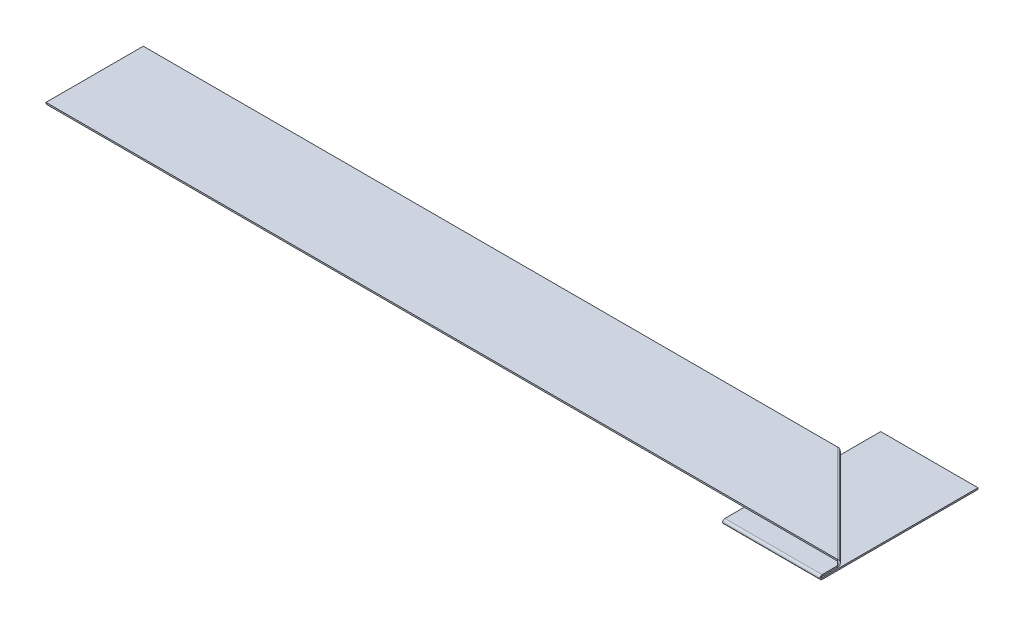
ISO-10303-21;
HEADER;
FILE_DESCRIPTION(('STEP AP214'),'2;1');
FILE_NAME('part.step','',(''),(''),'','','');
FILE_SCHEMA(('AUTOMOTIVE_DESIGN { 1 0 10303 214 1 1 1 1 }'));
ENDSEC;
DATA;
#1=APPLICATION_CONTEXT('core data for automotive mechanical design processes');
#2=APPLICATION_PROTOCOL_DEFINITION('international standard','automotive_design',2000,#1);
#3=PRODUCT_CONTEXT('',#1,'mechanical');
#4=PRODUCT('Part','Part','',(#3));
#5=PRODUCT_RELATED_PRODUCT_CATEGORY('part','',(#4));
#6=PRODUCT_DEFINITION_FORMATION('','',#4);
#7=PRODUCT_DEFINITION_CONTEXT('part definition',#1,'design');
#8=PRODUCT_DEFINITION('design','',#6,#7);
#9=PRODUCT_DEFINITION_SHAPE('','',#8);
#10=(LENGTH_UNIT() NAMED_UNIT(*) SI_UNIT(.MILLI.,.METRE.));
#11=(NAMED_UNIT(*) PLANE_ANGLE_UNIT() SI_UNIT($,.RADIAN.));
#12=(NAMED_UNIT(*) SI_UNIT($,.STERADIAN.) SOLID_ANGLE_UNIT());
#13=UNCERTAINTY_MEASURE_WITH_UNIT(LENGTH_MEASURE(1.E-05),#10,'distance_accuracy_value','');
#14=(GEOMETRIC_REPRESENTATION_CONTEXT(3) GLOBAL_UNCERTAINTY_ASSIGNED_CONTEXT((#13)) GLOBAL_UNIT_ASSIGNED_CONTEXT((#10,
#11,#12)) REPRESENTATION_CONTEXT('',''));
#15=CARTESIAN_POINT('',(0.,0.,0.));
#16=DIRECTION('',(0.,0.,1.));
#17=DIRECTION('',(1.,0.,0.));
#18=AXIS2_PLACEMENT_3D('',#15,#16,#17);
#19=CARTESIAN_POINT('',(0.,0.700000000000184,52.));
#20=DIRECTION('',(0.,-1.,0.));
#21=DIRECTION('',(0.,0.,-1.));
#22=AXIS2_PLACEMENT_3D('',#19,#20,#21);
#23=PLANE('',#22);
#24=DIRECTION('',(0.,0.,-1.));
#25=VECTOR('',#24,1.);
#26=CARTESIAN_POINT('',(16.,0.700000000000184,52.));
#27=LINE('',#26,#25);
#28=CARTESIAN_POINT('',(16.,0.7,25.6465708264711));
#29=VERTEX_POINT('',#28);
#30=CARTESIAN_POINT('',(16.,0.699999999999983,23.1463951570139));
#31=VERTEX_POINT('',#30);
#32=EDGE_CURVE('E79',#29,#31,#27,.T.);
#33=ORIENTED_EDGE('',*,*,#32,.T.);
#34=DIRECTION('',(-0.707106781186553,0.,-0.707106781186542));
#35=VECTOR('',#34,1.);
#36=CARTESIAN_POINT('',(22.4268024214929,0.700000000000027,29.5731975785067));
#37=LINE('',#36,#35);
#38=CARTESIAN_POINT('',(0.,0.699999999999871,7.14639515701417));
#39=VERTEX_POINT('',#38);
#40=EDGE_CURVE('E72',#31,#39,#37,.T.);
#41=ORIENTED_EDGE('',*,*,#40,.T.);
#42=DIRECTION('',(0.,0.,1.));
#43=VECTOR('',#42,1.);
#44=CARTESIAN_POINT('',(0.,0.700000000000184,52.));
#45=LINE('',#44,#43);
#46=CARTESIAN_POINT('',(0.,0.7,25.6465708264711));
#47=VERTEX_POINT('',#46);
#48=EDGE_CURVE('E87',#39,#47,#45,.T.);
#49=ORIENTED_EDGE('',*,*,#48,.T.);
#50=DIRECTION('',(-1.,0.,0.));
#51=VECTOR('',#50,1.);
#52=CARTESIAN_POINT('',(0.,0.7,25.6465708264711));
#53=LINE('',#52,#51);
#54=EDGE_CURVE('E349',#29,#47,#53,.T.);
#55=ORIENTED_EDGE('',*,*,#54,.F.);
#56=EDGE_LOOP('',(#33,#41,#49,#55));
#57=FACE_BOUND('',#56,.T.);
#58=ADVANCED_FACE('F60',(#57),#23,.F.);
#59=CARTESIAN_POINT('',(0.,0.450000000000184,52.));
#60=DIRECTION('',(-1.,0.,0.));
#61=DIRECTION('',(0.,0.,-1.));
#62=AXIS2_PLACEMENT_3D('',#59,#60,#61);
#63=PLANE('',#62);
#64=CARTESIAN_POINT('',(0.,0.449999999999871,7.14639515701417));
#65=CARTESIAN_POINT('',(0.,0.699999999999871,7.14639515701416));
#66=B_SPLINE_CURVE_WITH_KNOTS('',1,(#64,#65),.UNSPECIFIED.,.F.,.F.,(2,2),(0.,1.),.UNSPECIFIED.);
#67=CARTESIAN_POINT('',(0.,0.449999999999871,7.14639515701417));
#68=VERTEX_POINT('',#67);
#69=EDGE_CURVE('E290',#68,#39,#66,.T.);
#70=ORIENTED_EDGE('',*,*,#69,.F.);
#71=DIRECTION('',(0.,0.,1.));
#72=VECTOR('',#71,1.);
#73=CARTESIAN_POINT('',(0.,0.450000000000184,52.));
#74=LINE('',#73,#72);
#75=CARTESIAN_POINT('',(0.,0.45,25.6465708264711));
#76=VERTEX_POINT('',#75);
#77=EDGE_CURVE('E356',#68,#76,#74,.T.);
#78=ORIENTED_EDGE('',*,*,#77,.T.);
#79=DIRECTION('',(0.,1.,0.));
#80=VECTOR('',#79,1.);
#81=CARTESIAN_POINT('',(0.,0.449999999999998,25.6465708264711));
#82=LINE('',#81,#80);
#83=EDGE_CURVE('E352',#76,#47,#82,.T.);
#84=ORIENTED_EDGE('',*,*,#83,.T.);
#85=ORIENTED_EDGE('',*,*,#48,.F.);
#86=EDGE_LOOP('',(#70,#78,#84,#85));
#87=FACE_BOUND('',#86,.T.);
#88=ADVANCED_FACE('F387',(#87),#63,.T.);
#89=CARTESIAN_POINT('',(16.,0.450000000000184,52.));
#90=DIRECTION('',(1.,0.,0.));
#91=DIRECTION('',(0.,0.,1.));
#92=AXIS2_PLACEMENT_3D('',#89,#90,#91);
#93=PLANE('',#92);
#94=CARTESIAN_POINT('',(16.,0.699999999999983,23.1463951570139));
#95=CARTESIAN_POINT('',(16.,0.449999999999982,23.1463951570139));
#96=B_SPLINE_CURVE_WITH_KNOTS('',1,(#94,#95),.UNSPECIFIED.,.F.,.F.,(2,2),(0.,1.),.UNSPECIFIED.);
#97=CARTESIAN_POINT('',(16.,0.449999999999982,23.1463951570139));
#98=VERTEX_POINT('',#97);
#99=EDGE_CURVE('E12',#31,#98,#96,.T.);
#100=ORIENTED_EDGE('',*,*,#99,.F.);
#101=ORIENTED_EDGE('',*,*,#32,.F.);
#102=DIRECTION('',(0.,-1.,0.));
#103=VECTOR('',#102,1.);
#104=CARTESIAN_POINT('',(16.,0.449999999999998,25.6465708264711));
#105=LINE('',#104,#103);
#106=CARTESIAN_POINT('',(16.,0.45,25.6465708264711));
#107=VERTEX_POINT('',#106);
#108=EDGE_CURVE('E345',#29,#107,#105,.T.);
#109=ORIENTED_EDGE('',*,*,#108,.T.);
#110=DIRECTION('',(0.,0.,-1.));
#111=VECTOR('',#110,1.);
#112=CARTESIAN_POINT('',(16.,0.450000000000184,52.));
#113=LINE('',#112,#111);
#114=EDGE_CURVE('E346',#107,#98,#113,.T.);
#115=ORIENTED_EDGE('',*,*,#114,.T.);
#116=EDGE_LOOP('',(#100,#101,#109,#115));
#117=FACE_BOUND('',#116,.T.);
#118=ADVANCED_FACE('F62',(#117),#93,.T.);
#119=CARTESIAN_POINT('',(0.,0.450000000000184,52.));
#120=DIRECTION('',(0.,-1.,0.));
#121=DIRECTION('',(0.,0.,-1.));
#122=AXIS2_PLACEMENT_3D('',#119,#120,#121);
#123=PLANE('',#122);
#124=DIRECTION('',(-0.707106781186553,0.,-0.707106781186542));
#125=VECTOR('',#124,1.);
#126=CARTESIAN_POINT('',(22.4268024214929,0.450000000000027,29.5731975785067));
#127=LINE('',#126,#125);
#128=EDGE_CURVE('E354',#98,#68,#127,.T.);
#129=ORIENTED_EDGE('',*,*,#128,.F.);
#130=ORIENTED_EDGE('',*,*,#114,.F.);
#131=DIRECTION('',(-1.,0.,0.));
#132=VECTOR('',#131,1.);
#133=CARTESIAN_POINT('',(0.,0.45,25.6465708264711));
#134=LINE('',#133,#132);
#135=EDGE_CURVE('E342',#107,#76,#134,.T.);
#136=ORIENTED_EDGE('',*,*,#135,.T.);
#137=ORIENTED_EDGE('',*,*,#77,.F.);
#138=EDGE_LOOP('',(#129,#130,#136,#137));
#139=FACE_BOUND('',#138,.T.);
#140=ADVANCED_FACE('F396',(#139),#123,.T.);
#141=CARTESIAN_POINT('',(0.,0.25,0.));
#142=DIRECTION('',(0.,0.,-1.));
#143=DIRECTION('',(-1.,0.,0.));
#144=AXIS2_PLACEMENT_3D('',#141,#142,#143);
#145=PLANE('',#144);
#146=DIRECTION('',(1.,0.,0.));
#147=VECTOR('',#146,1.);
#148=CARTESIAN_POINT('',(0.,0.,0.));
#149=LINE('',#148,#147);
#150=CARTESIAN_POINT('',(0.,0.,0.));
#151=VERTEX_POINT('',#150);
#152=CARTESIAN_POINT('',(16.,0.,0.));
#153=VERTEX_POINT('',#152);
#154=EDGE_CURVE('E317',#151,#153,#149,.T.);
#155=ORIENTED_EDGE('',*,*,#154,.F.);
#156=DIRECTION('',(0.,-1.,0.));
#157=VECTOR('',#156,1.);
#158=CARTESIAN_POINT('',(0.,0.25,0.));
#159=LINE('',#158,#157);
#160=CARTESIAN_POINT('',(0.,0.25,0.));
#161=VERTEX_POINT('',#160);
#162=EDGE_CURVE('E312',#161,#151,#159,.T.);
#163=ORIENTED_EDGE('',*,*,#162,.F.);
#164=DIRECTION('',(1.,0.,0.));
#165=VECTOR('',#164,1.);
#166=CARTESIAN_POINT('',(0.,0.25,0.));
#167=LINE('',#166,#165);
#168=CARTESIAN_POINT('',(16.,0.25,0.));
#169=VERTEX_POINT('',#168);
#170=EDGE_CURVE('E331',#161,#169,#167,.T.);
#171=ORIENTED_EDGE('',*,*,#170,.T.);
#172=DIRECTION('',(0.,-1.,0.));
#173=VECTOR('',#172,1.);
#174=CARTESIAN_POINT('',(16.,0.25,0.));
#175=LINE('',#174,#173);
#176=EDGE_CURVE('E329',#169,#153,#175,.T.);
#177=ORIENTED_EDGE('',*,*,#176,.T.);
#178=EDGE_LOOP('',(#155,#163,#171,#177));
#179=FACE_BOUND('',#178,.T.);
#180=ADVANCED_FACE('F417',(#179),#145,.T.);
#181=CARTESIAN_POINT('',(0.,0.25,0.));
#182=DIRECTION('',(0.,1.,0.));
#183=DIRECTION('',(0.,0.,1.));
#184=AXIS2_PLACEMENT_3D('',#181,#182,#183);
#185=PLANE('',#184);
#186=DIRECTION('',(-1.,0.,0.));
#187=VECTOR('',#186,1.);
#188=CARTESIAN_POINT('',(0.,0.25,25.6465708264711));
#189=LINE('',#188,#187);
#190=CARTESIAN_POINT('',(16.,0.25,25.6465708264711));
#191=VERTEX_POINT('',#190);
#192=CARTESIAN_POINT('',(0.,0.25,25.6465708264711));
#193=VERTEX_POINT('',#192);
#194=EDGE_CURVE('E306',#191,#193,#189,.T.);
#195=ORIENTED_EDGE('',*,*,#194,.F.);
#196=DIRECTION('',(0.,0.,1.));
#197=VECTOR('',#196,1.);
#198=CARTESIAN_POINT('',(16.,0.25,0.));
#199=LINE('',#198,#197);
#200=EDGE_CURVE('E327',#169,#191,#199,.T.);
#201=ORIENTED_EDGE('',*,*,#200,.F.);
#202=ORIENTED_EDGE('',*,*,#170,.F.);
#203=DIRECTION('',(0.,0.,-1.));
#204=VECTOR('',#203,1.);
#205=CARTESIAN_POINT('',(0.,0.25,0.));
#206=LINE('',#205,#204);
#207=EDGE_CURVE('E315',#193,#161,#206,.T.);
#208=ORIENTED_EDGE('',*,*,#207,.F.);
#209=EDGE_LOOP('',(#195,#201,#202,#208));
#210=FACE_BOUND('',#209,.T.);
#211=ADVANCED_FACE('F425',(#210),#185,.T.);
#212=CARTESIAN_POINT('',(16.,0.25,0.));
#213=DIRECTION('',(1.,0.,0.));
#214=DIRECTION('',(0.,0.,-1.));
#215=AXIS2_PLACEMENT_3D('',#212,#213,#214);
#216=PLANE('',#215);
#217=DIRECTION('',(0.,1.,0.));
#218=VECTOR('',#217,1.);
#219=CARTESIAN_POINT('',(16.,0.250000000000002,25.6465708264711));
#220=LINE('',#219,#218);
#221=CARTESIAN_POINT('',(16.,0.,25.6465708264711));
#222=VERTEX_POINT('',#221);
#223=EDGE_CURVE('E334',#222,#191,#220,.T.);
#224=ORIENTED_EDGE('',*,*,#223,.F.);
#225=DIRECTION('',(0.,0.,1.));
#226=VECTOR('',#225,1.);
#227=CARTESIAN_POINT('',(16.,0.,0.));
#228=LINE('',#227,#226);
#229=EDGE_CURVE('E325',#153,#222,#228,.T.);
#230=ORIENTED_EDGE('',*,*,#229,.F.);
#231=ORIENTED_EDGE('',*,*,#176,.F.);
#232=ORIENTED_EDGE('',*,*,#200,.T.);
#233=EDGE_LOOP('',(#224,#230,#231,#232));
#234=FACE_BOUND('',#233,.T.);
#235=ADVANCED_FACE('F433',(#234),#216,.T.);
#236=CARTESIAN_POINT('',(0.,0.,0.));
#237=DIRECTION('',(0.,1.,0.));
#238=DIRECTION('',(0.,0.,1.));
#239=AXIS2_PLACEMENT_3D('',#236,#237,#238);
#240=PLANE('',#239);
#241=ORIENTED_EDGE('',*,*,#229,.T.);
#242=DIRECTION('',(-1.,0.,0.));
#243=VECTOR('',#242,1.);
#244=CARTESIAN_POINT('',(0.,0.,25.6465708264711));
#245=LINE('',#244,#243);
#246=CARTESIAN_POINT('',(0.,0.,25.6465708264711));
#247=VERTEX_POINT('',#246);
#248=EDGE_CURVE('E322',#222,#247,#245,.T.);
#249=ORIENTED_EDGE('',*,*,#248,.T.);
#250=DIRECTION('',(0.,0.,-1.));
#251=VECTOR('',#250,1.);
#252=CARTESIAN_POINT('',(0.,0.,0.));
#253=LINE('',#252,#251);
#254=EDGE_CURVE('E320',#247,#151,#253,.T.);
#255=ORIENTED_EDGE('',*,*,#254,.T.);
#256=ORIENTED_EDGE('',*,*,#154,.T.);
#257=EDGE_LOOP('',(#241,#249,#255,#256));
#258=FACE_BOUND('',#257,.T.);
#259=ADVANCED_FACE('F441',(#258),#240,.F.);
#260=CARTESIAN_POINT('',(0.,0.25,0.));
#261=DIRECTION('',(-1.,0.,0.));
#262=DIRECTION('',(0.,0.,1.));
#263=AXIS2_PLACEMENT_3D('',#260,#261,#262);
#264=PLANE('',#263);
#265=DIRECTION('',(0.,-1.,0.));
#266=VECTOR('',#265,1.);
#267=CARTESIAN_POINT('',(0.,0.250000000000002,25.6465708264711));
#268=LINE('',#267,#266);
#269=EDGE_CURVE('E337',#193,#247,#268,.T.);
#270=ORIENTED_EDGE('',*,*,#269,.F.);
#271=ORIENTED_EDGE('',*,*,#207,.T.);
#272=ORIENTED_EDGE('',*,*,#162,.T.);
#273=ORIENTED_EDGE('',*,*,#254,.F.);
#274=EDGE_LOOP('',(#270,#271,#272,#273));
#275=FACE_BOUND('',#274,.T.);
#276=ADVANCED_FACE('F450',(#275),#264,.T.);
#277=CARTESIAN_POINT('',(16.,0.35,25.6465708264711));
#278=DIRECTION('',(-1.,0.,0.));
#279=DIRECTION('',(0.,0.,1.));
#280=AXIS2_PLACEMENT_3D('',#277,#278,#279);
#281=PLANE('',#280);
#282=ORIENTED_EDGE('',*,*,#108,.F.);
#283=CARTESIAN_POINT('',(16.,0.35,25.6465708264711));
#284=DIRECTION('',(1.,0.,0.));
#285=DIRECTION('',(0.,0.,-1.));
#286=AXIS2_PLACEMENT_3D('',#283,#284,#285);
#287=CIRCLE('',#286,0.35);
#288=EDGE_CURVE('E307',#29,#222,#287,.T.);
#289=ORIENTED_EDGE('',*,*,#288,.T.);
#290=ORIENTED_EDGE('',*,*,#223,.T.);
#291=CARTESIAN_POINT('',(16.,0.35,25.6465708264711));
#292=DIRECTION('',(1.,0.,0.));
#293=DIRECTION('',(0.,0.,1.));
#294=AXIS2_PLACEMENT_3D('',#291,#292,#293);
#295=CIRCLE('',#294,0.1);
#296=EDGE_CURVE('E294',#107,#191,#295,.T.);
#297=ORIENTED_EDGE('',*,*,#296,.F.);
#298=EDGE_LOOP('',(#282,#289,#290,#297));
#299=FACE_BOUND('',#298,.T.);
#300=ADVANCED_FACE('F458',(#299),#281,.F.);
#301=CARTESIAN_POINT('',(0.,0.35,25.6465708264711));
#302=DIRECTION('',(1.,0.,0.));
#303=DIRECTION('',(0.,0.,-1.));
#304=AXIS2_PLACEMENT_3D('',#301,#302,#303);
#305=PLANE('',#304);
#306=CARTESIAN_POINT('',(0.,0.35,25.6465708264711));
#307=DIRECTION('',(1.,0.,0.));
#308=DIRECTION('',(0.,0.,-1.));
#309=AXIS2_PLACEMENT_3D('',#306,#307,#308);
#310=CIRCLE('',#309,0.35);
#311=EDGE_CURVE('E303',#247,#47,#310,.F.);
#312=ORIENTED_EDGE('',*,*,#311,.T.);
#313=ORIENTED_EDGE('',*,*,#83,.F.);
#314=CARTESIAN_POINT('',(0.,0.35,25.6465708264711));
#315=DIRECTION('',(-1.,0.,0.));
#316=DIRECTION('',(0.,0.,-1.));
#317=AXIS2_PLACEMENT_3D('',#314,#315,#316);
#318=CIRCLE('',#317,0.1);
#319=EDGE_CURVE('E302',#193,#76,#318,.T.);
#320=ORIENTED_EDGE('',*,*,#319,.F.);
#321=ORIENTED_EDGE('',*,*,#269,.T.);
#322=EDGE_LOOP('',(#312,#313,#320,#321));
#323=FACE_BOUND('',#322,.T.);
#324=ADVANCED_FACE('F465',(#323),#305,.F.);
#325=CARTESIAN_POINT('',(-8.01755751426557,0.35,25.6465708264711));
#326=DIRECTION('',(1.,0.,0.));
#327=DIRECTION('',(0.,0.,-1.));
#328=AXIS2_PLACEMENT_3D('',#325,#326,#327);
#329=CYLINDRICAL_SURFACE('',#328,0.1);
#330=ORIENTED_EDGE('',*,*,#194,.T.);
#331=ORIENTED_EDGE('',*,*,#319,.T.);
#332=ORIENTED_EDGE('',*,*,#135,.F.);
#333=ORIENTED_EDGE('',*,*,#296,.T.);
#334=EDGE_LOOP('',(#330,#331,#332,#333));
#335=FACE_BOUND('',#334,.T.);
#336=ADVANCED_FACE('F265',(#335),#329,.F.);
#337=CARTESIAN_POINT('',(-8.01755751426557,0.35,25.6465708264711));
#338=DIRECTION('',(1.,0.,0.));
#339=DIRECTION('',(0.,0.,-1.));
#340=AXIS2_PLACEMENT_3D('',#337,#338,#339);
#341=CYLINDRICAL_SURFACE('',#340,0.35);
#342=ORIENTED_EDGE('',*,*,#248,.F.);
#343=ORIENTED_EDGE('',*,*,#288,.F.);
#344=ORIENTED_EDGE('',*,*,#54,.T.);
#345=ORIENTED_EDGE('',*,*,#311,.F.);
#346=EDGE_LOOP('',(#342,#343,#344,#345));
#347=FACE_BOUND('',#346,.T.);
#348=ADVANCED_FACE('F482',(#347),#341,.T.);
#349=CARTESIAN_POINT('',(15.5001756694572,1.14999999999998,22.6465708264711));
#350=CARTESIAN_POINT('',(15.5537921167749,1.14999999999998,22.6188467692373));
#351=CARTESIAN_POINT('',(15.610145320859,1.13555392953664,22.5940041537666));
#352=CARTESIAN_POINT('',(15.718938512228,1.08115460482738,22.5595312619955));
#353=CARTESIAN_POINT('',(15.7712872506231,1.04125420669122,22.5499817803662));
#354=CARTESIAN_POINT('',(15.8646371181336,0.945401271251354,22.5535086403211));
#355=CARTESIAN_POINT('',(15.9055946098356,0.889541867676836,22.5666286193186));
#356=CARTESIAN_POINT('',(15.9434051297194,0.825137932580997,22.5959992493095));
#357=CARTESIAN_POINT('',(15.9474944555379,0.817961511614417,22.5994626067456));
#358=CARTESIAN_POINT('',(15.9524655671424,0.808982460021814,22.6040424880173));
#359=CARTESIAN_POINT('',(15.9534527650749,0.807186223669721,22.6049709956005));
#360=CARTESIAN_POINT('',(15.9554131052039,0.803593324876642,22.6068530803836));
#361=CARTESIAN_POINT('',(15.9567983305608,0.80103031915711,22.6082187407441));
#362=CARTESIAN_POINT('',(15.9584604205846,0.797939361685722,22.609880830768));
#363=CARTESIAN_POINT('',(15.9595718933155,0.795873565118556,22.611018040062));
#364=CARTESIAN_POINT('',(15.9651453621157,0.785520422299517,22.6168507913512));
#365=CARTESIAN_POINT('',(15.9696556014448,0.777160402464013,22.6219865199826));
#366=CARTESIAN_POINT('',(15.9787555724744,0.760330208940822,22.6332204686517));
#367=CARTESIAN_POINT('',(15.983345289421,0.751860036426322,22.6393187034434));
#368=CARTESIAN_POINT('',(15.9902734569191,0.739109515053051,22.6492039513861));
#369=CARTESIAN_POINT('',(15.9925901291847,0.734851836035317,22.6526219989062));
#370=CARTESIAN_POINT('',(15.9960742359479,0.728459072468827,22.6579353437801));
#371=CARTESIAN_POINT('',(15.9972371225527,0.726327112811992,22.6597375030474));
#372=CARTESIAN_POINT('',(15.9995656428455,0.722061980312805,22.6634041984848));
#373=CARTESIAN_POINT('',(16.0010711164162,0.71930749213181,22.665820887556));
#374=CARTESIAN_POINT('',(16.0283630676331,0.66941073736815,22.7101633255669));
#375=CARTESIAN_POINT('',(16.0474316350071,0.607995948186441,22.7656042844376));
#376=CARTESIAN_POINT('',(16.0493082551733,0.497799445262164,22.9228384689295));
#377=CARTESIAN_POINT('',(16.0303469008345,0.449999999999981,23.0253772745847));
#378=CARTESIAN_POINT('',(16.,0.449999999999982,23.1463951570139));
#379=CARTESIAN_POINT('',(15.5001756694572,0.899999999999979,22.6465708264711));
#380=CARTESIAN_POINT('',(15.5247368917391,0.899999999999979,22.6478966771065));
#381=CARTESIAN_POINT('',(15.5520966336782,0.895872551296167,22.6520528409475));
#382=CARTESIAN_POINT('',(15.6097233667829,0.880329887093522,22.6687464074407));
#383=CARTESIAN_POINT('',(15.6399655980264,0.868929773340333,22.6813034329629));
#384=CARTESIAN_POINT('',(15.7012358199813,0.841543220357516,22.7169099384734));
#385=CARTESIAN_POINT('',(15.7322513428603,0.825583390764796,22.7399718862939));
#386=CARTESIAN_POINT('',(15.7670476163537,0.807182266451699,22.7723567626751));
#387=CARTESIAN_POINT('',(15.7709133820357,0.805131860461248,22.7760436802478));
#388=CARTESIAN_POINT('',(15.7757447685214,0.802566417149076,22.7807632866384));
#389=CARTESIAN_POINT('',(15.7767110056148,0.802053206762763,22.7817127550606));
#390=CARTESIAN_POINT('',(15.778643397406,0.801026664250455,22.7836227881816));
#391=CARTESIAN_POINT('',(15.7800216352641,0.800294376902017,22.7849954360408));
#392=CARTESIAN_POINT('',(15.781683725288,0.799411246195907,22.7866575260646));
#393=CARTESIAN_POINT('',(15.7828043896485,0.798821018605288,22.7877855437289));
#394=CARTESIAN_POINT('',(15.7884704593377,0.795862977799848,22.7935256941292));
#395=CARTESIAN_POINT('',(15.7932040877033,0.79347440070399,22.7984380337241));
#396=CARTESIAN_POINT('',(15.8030661936042,0.788665773983078,22.8089098475219));
#397=CARTESIAN_POINT('',(15.808194666924,0.786245724693221,22.8144693259404));
#398=CARTESIAN_POINT('',(15.8161789345809,0.782602718586572,22.8232984737242));
#399=CARTESIAN_POINT('',(15.8188889551517,0.78138623886722,22.8263231729392));
#400=CARTESIAN_POINT('',(15.8230263612401,0.77955973499108,22.8309832184878));
#401=CARTESIAN_POINT('',(15.8244175595101,0.778950603660555,22.83255706609));
#402=CARTESIAN_POINT('',(15.8272239994974,0.777731994375073,22.8357458418329));
#403=CARTESIAN_POINT('',(15.8290549071755,0.776944997751932,22.8378370967968));
#404=CARTESIAN_POINT('',(15.8624363179617,0.762688782105172,22.8760900752384));
#405=CARTESIAN_POINT('',(15.8944950251559,0.745141699481827,22.9185408942888));
#406=CARTESIAN_POINT('',(15.9518564897241,0.713656984360605,23.0202902343787));
#407=CARTESIAN_POINT('',(15.9764883682956,0.699999999999982,23.080001795845));
#408=CARTESIAN_POINT('',(16.,0.699999999999983,23.1463951570139));
#409=B_SPLINE_SURFACE_WITH_KNOTS('',1,3,((#349,#350,#351,#352,#353,#354,#355,#356,#357,#358,
#359,#360,#361,#362,#363,#364,#365,#366,#367,#368,#369,#370,#371,#372,#373,#374,#375,#376,#377,
#378),(#379,#380,#381,#382,#383,#384,#385,#386,#387,#388,#389,#390,#391,#392,#393,#394,#395,
#396,#397,#398,#399,#400,#401,#402,#403,#404,#405,#406,#407,#408)),.UNSPECIFIED.,.F.,.F.,.F.,(2,
2),(4,2,2,2,2,2,2,2,2,2,2,2,2,2,4),(0.,1.),(0.,0.125,0.25,0.375,0.390625,0.39453125,0.3984375,
0.40625,0.4375,0.46875,0.484375,0.4921875,0.5,0.75,1.),.UNSPECIFIED.);
#410=CARTESIAN_POINT('',(15.5001756694572,1.14999999999998,22.6465708264711));
#411=CARTESIAN_POINT('',(15.5001756694572,0.899999999999979,22.6465708264711));
#412=B_SPLINE_CURVE_WITH_KNOTS('',1,(#410,#411),.UNSPECIFIED.,.F.,.F.,(2,2),(0.,1.),.UNSPECIFIED.);
#413=CARTESIAN_POINT('',(15.5001756694572,0.899999999999979,22.6465708264711));
#414=VERTEX_POINT('',#413);
#415=CARTESIAN_POINT('',(15.5001756694572,1.14999999999998,22.6465708264711));
#416=VERTEX_POINT('',#415);
#417=EDGE_CURVE('E161',#414,#416,#412,.F.);
#418=CARTESIAN_POINT('',(15.5001756694572,0.899999999999979,22.6465708264711));
#419=CARTESIAN_POINT('',(15.5247368917391,0.899999999999979,22.6478966771065));
#420=CARTESIAN_POINT('',(15.5520966336782,0.895872551296167,22.6520528409475));
#421=CARTESIAN_POINT('',(15.6097233667829,0.880329887093522,22.6687464074407));
#422=CARTESIAN_POINT('',(15.6399655980264,0.868929773340333,22.6813034329629));
#423=CARTESIAN_POINT('',(15.7012358199813,0.841543220357516,22.7169099384734));
#424=CARTESIAN_POINT('',(15.7322513428603,0.825583390764796,22.7399718862939));
#425=CARTESIAN_POINT('',(15.7670476163537,0.807182266451699,22.7723567626751));
#426=CARTESIAN_POINT('',(15.7709133820357,0.805131860461248,22.7760436802478));
#427=CARTESIAN_POINT('',(15.7757447685214,0.802566417149076,22.7807632866384));
#428=CARTESIAN_POINT('',(15.7767110056148,0.802053206762763,22.7817127550606));
#429=CARTESIAN_POINT('',(15.778643397406,0.801026664250455,22.7836227881816));
#430=CARTESIAN_POINT('',(15.7800216352641,0.800294376902017,22.7849954360408));
#431=CARTESIAN_POINT('',(15.781683725288,0.799411246195907,22.7866575260646));
#432=CARTESIAN_POINT('',(15.7828043896485,0.798821018605288,22.7877855437289));
#433=CARTESIAN_POINT('',(15.7884704593377,0.795862977799848,22.7935256941292));
#434=CARTESIAN_POINT('',(15.7932040877033,0.79347440070399,22.7984380337241));
#435=CARTESIAN_POINT('',(15.8030661936042,0.788665773983078,22.8089098475219));
#436=CARTESIAN_POINT('',(15.808194666924,0.786245724693221,22.8144693259404));
#437=CARTESIAN_POINT('',(15.8161789345809,0.782602718586572,22.8232984737242));
#438=CARTESIAN_POINT('',(15.8188889551517,0.78138623886722,22.8263231729392));
#439=CARTESIAN_POINT('',(15.8230263612401,0.77955973499108,22.8309832184878));
#440=CARTESIAN_POINT('',(15.8244175595101,0.778950603660555,22.83255706609));
#441=CARTESIAN_POINT('',(15.8272239994974,0.777731994375073,22.8357458418329));
#442=CARTESIAN_POINT('',(15.8290549071755,0.776944997751932,22.8378370967968));
#443=CARTESIAN_POINT('',(15.8624363179617,0.762688782105172,22.8760900752384));
#444=CARTESIAN_POINT('',(15.8944950251559,0.745141699481827,22.9185408942888));
#445=CARTESIAN_POINT('',(15.9518564897241,0.713656984360605,23.0202902343787));
#446=CARTESIAN_POINT('',(15.9764883682956,0.699999999999982,23.080001795845));
#447=CARTESIAN_POINT('',(16.,0.699999999999983,23.1463951570139));
#448=B_SPLINE_CURVE_WITH_KNOTS('',3,(#418,#419,#420,#421,#422,#423,#424,#425,#426,#427,#428,
#429,#430,#431,#432,#433,#434,#435,#436,#437,#438,#439,#440,#441,#442,#443,#444,#445,#446,#447),
.UNSPECIFIED.,.F.,.F.,(4,2,2,2,2,2,2,2,2,2,2,2,2,2,4),(0.,0.125,0.25,0.375,0.390625,0.39453125,
0.3984375,0.40625,0.4375,0.46875,0.484375,0.4921875,0.5,0.75,1.),.UNSPECIFIED.);
#449=EDGE_CURVE('E172',#414,#31,#448,.T.);
#450=CARTESIAN_POINT('',(16.,0.449999999999982,23.1463951570139));
#451=CARTESIAN_POINT('',(16.0303469008345,0.449999999999981,23.0253772745847));
#452=CARTESIAN_POINT('',(16.0493082551733,0.497799445262164,22.9228384689295));
#453=CARTESIAN_POINT('',(16.0474316350071,0.607995948186441,22.7656042844376));
#454=CARTESIAN_POINT('',(16.0283630676331,0.66941073736815,22.7101633255669));
#455=CARTESIAN_POINT('',(16.0010711164162,0.71930749213181,22.665820887556));
#456=CARTESIAN_POINT('',(15.9995656428455,0.722061980312805,22.6634041984848));
#457=CARTESIAN_POINT('',(15.9972371225527,0.726327112811992,22.6597375030474));
#458=CARTESIAN_POINT('',(15.9960742359479,0.728459072468827,22.6579353437801));
#459=CARTESIAN_POINT('',(15.9925901291847,0.734851836035317,22.6526219989062));
#460=CARTESIAN_POINT('',(15.9902734569191,0.739109515053051,22.6492039513861));
#461=CARTESIAN_POINT('',(15.983345289421,0.751860036426322,22.6393187034434));
#462=CARTESIAN_POINT('',(15.9787555724744,0.760330208940822,22.6332204686517));
#463=CARTESIAN_POINT('',(15.9696556014448,0.777160402464013,22.6219865199826));
#464=CARTESIAN_POINT('',(15.9651453621157,0.785520422299517,22.6168507913512));
#465=CARTESIAN_POINT('',(15.9595718933155,0.795873565118556,22.611018040062));
#466=CARTESIAN_POINT('',(15.9584604205846,0.797939361685722,22.609880830768));
#467=CARTESIAN_POINT('',(15.9567983305608,0.80103031915711,22.6082187407441));
#468=CARTESIAN_POINT('',(15.9554131052039,0.803593324876642,22.6068530803836));
#469=CARTESIAN_POINT('',(15.9534527650749,0.807186223669721,22.6049709956005));
#470=CARTESIAN_POINT('',(15.9524655671424,0.808982460021814,22.6040424880173));
#471=CARTESIAN_POINT('',(15.9474944555379,0.817961511614417,22.5994626067456));
#472=CARTESIAN_POINT('',(15.9434051297194,0.825137932580997,22.5959992493095));
#473=CARTESIAN_POINT('',(15.9055946098356,0.889541867676836,22.5666286193186));
#474=CARTESIAN_POINT('',(15.8646371181336,0.945401271251354,22.5535086403211));
#475=CARTESIAN_POINT('',(15.7712872506231,1.04125420669122,22.5499817803662));
#476=CARTESIAN_POINT('',(15.718938512228,1.08115460482738,22.5595312619955));
#477=CARTESIAN_POINT('',(15.610145320859,1.13555392953664,22.5940041537666));
#478=CARTESIAN_POINT('',(15.5537921167749,1.14999999999998,22.6188467692373));
#479=CARTESIAN_POINT('',(15.5001756694572,1.14999999999998,22.6465708264711));
#480=B_SPLINE_CURVE_WITH_KNOTS('',3,(#450,#451,#452,#453,#454,#455,#456,#457,#458,#459,#460,
#461,#462,#463,#464,#465,#466,#467,#468,#469,#470,#471,#472,#473,#474,#475,#476,#477,#478,#479),
.UNSPECIFIED.,.F.,.F.,(4,2,2,2,2,2,2,2,2,2,2,2,2,2,4),(0.,0.25,0.5,0.5078125,0.515625,0.53125,
0.5625,0.59375,0.6015625,0.60546875,0.609375,0.625,0.75,0.875,1.),.UNSPECIFIED.);
#481=EDGE_CURVE('E688',#416,#98,#480,.F.);
#482=ORIENTED_EDGE('',*,*,#417,.F.);
#483=ORIENTED_EDGE('',*,*,#449,.T.);
#484=ORIENTED_EDGE('',*,*,#99,.T.);
#485=ORIENTED_EDGE('',*,*,#481,.F.);
#486=EDGE_LOOP('',(#482,#483,#484,#485));
#487=FACE_BOUND('',#486,.T.);
#488=ADVANCED_FACE('F261',(#487),#409,.T.);
#489=CARTESIAN_POINT('',(0.,0.449999999999871,7.14639515701417));
#490=CARTESIAN_POINT('',(0.0277240572280018,0.44999999999987,7.09277870969062));
#491=CARTESIAN_POINT('',(0.0525666726946304,0.464446070463212,7.03642550560246));
#492=CARTESIAN_POINT('',(0.0870395644613408,0.518845395172469,6.92763231422912));
#493=CARTESIAN_POINT('',(0.0965890460903188,0.558745793308632,6.87528357583365));
#494=CARTESIAN_POINT('',(0.0930621861384264,0.654598728748494,6.78193370832618));
#495=CARTESIAN_POINT('',(0.0799422071442353,0.710458132323013,6.74097621662751));
#496=CARTESIAN_POINT('',(0.0505715771592036,0.774862067418853,6.70316569674949));
#497=CARTESIAN_POINT('',(0.0471082197237716,0.782038488385433,6.69907637093162));
#498=CARTESIAN_POINT('',(0.0425283384528825,0.791017539978035,6.694105259328));
#499=CARTESIAN_POINT('',(0.0415998308698983,0.792813776330129,6.69311806139569));
#500=CARTESIAN_POINT('',(0.0397177460871115,0.796406675123208,6.6911577212671));
#501=CARTESIAN_POINT('',(0.0383520857264845,0.798969680843466,6.68977249591007));
#502=CARTESIAN_POINT('',(0.0366899957041341,0.802060638312675,6.68811040588772));
#503=CARTESIAN_POINT('',(0.0355527864110862,0.8041264348785,6.68699893315776));
#504=CARTESIAN_POINT('',(0.0297200351262177,0.814479577691397,6.68142546436154));
#505=CARTESIAN_POINT('',(0.0245843064972658,0.822839597523787,6.67691522503429));
#506=CARTESIAN_POINT('',(0.0133503578306321,0.839669791044363,6.66781525400584));
#507=CARTESIAN_POINT('',(0.00725212303891071,0.848139963559361,6.66322553705869));
#508=CARTESIAN_POINT('',(-0.00263312490611063,0.860890484936009,6.6562973695584));
#509=CARTESIAN_POINT('',(-0.00605117242744464,0.865148163955307,6.65398069729179));
#510=CARTESIAN_POINT('',(-0.0113645173037075,0.87154092752478,6.6504965905269));
#511=CARTESIAN_POINT('',(-0.0131666765718935,0.873672887182715,6.64933370392149));
#512=CARTESIAN_POINT('',(-0.0168333720112998,0.877938019684312,6.64700518362729));
#513=CARTESIAN_POINT('',(-0.0192500610847591,0.880692507867913,6.64549971005516));
#514=CARTESIAN_POINT('',(-0.0635924990985225,0.930589262635331,6.61820775883674));
#515=CARTESIAN_POINT('',(-0.119033457971828,0.992004051818261,6.59913919146325));
#516=CARTESIAN_POINT('',(-0.276267642465013,1.10220055474078,6.59726257129837));
#517=CARTESIAN_POINT('',(-0.378806448118535,1.14999999999986,6.61622392563739));
#518=CARTESIAN_POINT('',(-0.499824330542794,1.14999999999987,6.64657082647135));
#519=CARTESIAN_POINT('',(0.,0.699999999999871,7.14639515701416));
#520=CARTESIAN_POINT('',(-0.00132585064121473,0.69999999999987,7.1218339347264));
#521=CARTESIAN_POINT('',(-0.00548201448620411,0.704127448703682,7.09447419278329));
#522=CARTESIAN_POINT('',(-0.0221755809837956,0.719670112906326,7.03684745967426));
#523=CARTESIAN_POINT('',(-0.0347326065064068,0.731070226659516,7.00660522843038));
#524=CARTESIAN_POINT('',(-0.0703391120138617,0.758456779642334,6.94533500647847));
#525=CARTESIAN_POINT('',(-0.0934010598310798,0.774416609235053,6.91431948360283));
#526=CARTESIAN_POINT('',(-0.125785936206464,0.79281773354815,6.87952321011517));
#527=CARTESIAN_POINT('',(-0.129472853778484,0.794868139538602,6.87565744443388));
#528=CARTESIAN_POINT('',(-0.134192460168205,0.797433582850774,6.87082605794909));
#529=CARTESIAN_POINT('',(-0.135141928590234,0.797946793237087,6.86985982085583));
#530=CARTESIAN_POINT('',(-0.137051961710808,0.798973335749395,6.86792742906502));
#531=CARTESIAN_POINT('',(-0.138424609570151,0.79970562309804,6.86654919120671));
#532=CARTESIAN_POINT('',(-0.140086699592502,0.800588753803528,6.86488710118436));
#533=CARTESIAN_POINT('',(-0.141214717255874,0.801178981393764,6.86376643682472));
#534=CARTESIAN_POINT('',(-0.146954867651939,0.804137022197449,6.8581003671397));
#535=CARTESIAN_POINT('',(-0.15186720724457,0.806525599292417,6.85336673877613));
#536=CARTESIAN_POINT('',(-0.162339021040422,0.811334226012582,6.8435046328769));
#537=CARTESIAN_POINT('',(-0.167898499459083,0.813754275302581,6.83837615955669));
#538=CARTESIAN_POINT('',(-0.176727647245273,0.817397281410195,6.83039189189756));
#539=CARTESIAN_POINT('',(-0.179752346461346,0.818613761129994,6.8276818713257));
#540=CARTESIAN_POINT('',(-0.18441239201212,0.820440265006986,6.82354446523532));
#541=CARTESIAN_POINT('',(-0.185986239615028,0.821049396337825,6.82215326696463));
#542=CARTESIAN_POINT('',(-0.189175015359717,0.822268005623995,6.81934682697571));
#543=CARTESIAN_POINT('',(-0.191266270325559,0.823055002247882,6.81751591929597));
#544=CARTESIAN_POINT('',(-0.229519248769559,0.837311217895715,6.78413450850778));
#545=CARTESIAN_POINT('',(-0.271970067821501,0.854858300519409,6.75207580131293));
#546=CARTESIAN_POINT('',(-0.373719407911722,0.886343015640128,6.69471433674508));
#547=CARTESIAN_POINT('',(-0.433430969376704,0.899999999999866,6.6700824581744));
#548=CARTESIAN_POINT('',(-0.499824330542801,0.899999999999867,6.64657082647136));
#549=B_SPLINE_SURFACE_WITH_KNOTS('',1,3,((#489,#490,#491,#492,#493,#494,#495,#496,#497,#498,
#499,#500,#501,#502,#503,#504,#505,#506,#507,#508,#509,#510,#511,#512,#513,#514,#515,#516,#517,
#518),(#519,#520,#521,#522,#523,#524,#525,#526,#527,#528,#529,#530,#531,#532,#533,#534,#535,
#536,#537,#538,#539,#540,#541,#542,#543,#544,#545,#546,#547,#548)),.UNSPECIFIED.,.F.,.F.,.F.,(2,
2),(4,2,2,2,2,2,2,2,2,2,2,2,2,2,4),(0.,1.),(0.,0.125,0.25,0.375,0.390625,0.39453125,0.3984375,
0.40625,0.4375,0.46875,0.484375,0.4921875,0.5,0.75,1.),.UNSPECIFIED.);
#550=CARTESIAN_POINT('',(0.,0.699999999999871,7.14639515701416));
#551=CARTESIAN_POINT('',(-0.00132585064121473,0.69999999999987,7.1218339347264));
#552=CARTESIAN_POINT('',(-0.00548201448620411,0.704127448703682,7.09447419278329));
#553=CARTESIAN_POINT('',(-0.0221755809837956,0.719670112906326,7.03684745967426));
#554=CARTESIAN_POINT('',(-0.0347326065064068,0.731070226659516,7.00660522843038));
#555=CARTESIAN_POINT('',(-0.0703391120138617,0.758456779642334,6.94533500647847));
#556=CARTESIAN_POINT('',(-0.0934010598310798,0.774416609235053,6.91431948360283));
#557=CARTESIAN_POINT('',(-0.125785936206464,0.79281773354815,6.87952321011517));
#558=CARTESIAN_POINT('',(-0.129472853778484,0.794868139538602,6.87565744443388));
#559=CARTESIAN_POINT('',(-0.134192460168205,0.797433582850774,6.87082605794909));
#560=CARTESIAN_POINT('',(-0.135141928590234,0.797946793237087,6.86985982085583));
#561=CARTESIAN_POINT('',(-0.137051961710808,0.798973335749395,6.86792742906502));
#562=CARTESIAN_POINT('',(-0.138424609570151,0.79970562309804,6.86654919120671));
#563=CARTESIAN_POINT('',(-0.140086699592502,0.800588753803528,6.86488710118436));
#564=CARTESIAN_POINT('',(-0.141214717255874,0.801178981393764,6.86376643682472));
#565=CARTESIAN_POINT('',(-0.146954867651939,0.804137022197449,6.8581003671397));
#566=CARTESIAN_POINT('',(-0.15186720724457,0.806525599292417,6.85336673877613));
#567=CARTESIAN_POINT('',(-0.162339021040422,0.811334226012582,6.8435046328769));
#568=CARTESIAN_POINT('',(-0.167898499459083,0.813754275302581,6.83837615955669));
#569=CARTESIAN_POINT('',(-0.176727647245273,0.817397281410195,6.83039189189756));
#570=CARTESIAN_POINT('',(-0.179752346461346,0.818613761129994,6.8276818713257));
#571=CARTESIAN_POINT('',(-0.18441239201212,0.820440265006986,6.82354446523532));
#572=CARTESIAN_POINT('',(-0.185986239615028,0.821049396337825,6.82215326696463));
#573=CARTESIAN_POINT('',(-0.189175015359717,0.822268005623995,6.81934682697571));
#574=CARTESIAN_POINT('',(-0.191266270325559,0.823055002247882,6.81751591929597));
#575=CARTESIAN_POINT('',(-0.229519248769559,0.837311217895715,6.78413450850778));
#576=CARTESIAN_POINT('',(-0.271970067821501,0.854858300519409,6.75207580131293));
#577=CARTESIAN_POINT('',(-0.373719407911722,0.886343015640128,6.69471433674508));
#578=CARTESIAN_POINT('',(-0.433430969376704,0.899999999999866,6.6700824581744));
#579=CARTESIAN_POINT('',(-0.499824330542801,0.899999999999867,6.64657082647136));
#580=B_SPLINE_CURVE_WITH_KNOTS('',3,(#550,#551,#552,#553,#554,#555,#556,#557,#558,#559,#560,
#561,#562,#563,#564,#565,#566,#567,#568,#569,#570,#571,#572,#573,#574,#575,#576,#577,#578,#579),
.UNSPECIFIED.,.F.,.F.,(4,2,2,2,2,2,2,2,2,2,2,2,2,2,4),(0.,0.125,0.25,0.375,0.390625,0.39453125,
0.3984375,0.40625,0.4375,0.46875,0.484375,0.4921875,0.5,0.75,1.),.UNSPECIFIED.);
#581=CARTESIAN_POINT('',(-0.499824330542818,0.899999999999867,6.64657082647137));
#582=VERTEX_POINT('',#581);
#583=EDGE_CURVE('E233',#39,#582,#580,.T.);
#584=CARTESIAN_POINT('',(-0.499824330542801,0.899999999999867,6.64657082647136));
#585=CARTESIAN_POINT('',(-0.499824330542794,1.14999999999987,6.64657082647135));
#586=B_SPLINE_CURVE_WITH_KNOTS('',1,(#584,#585),.UNSPECIFIED.,.F.,.F.,(2,2),(0.,1.),.UNSPECIFIED.);
#587=CARTESIAN_POINT('',(-0.499824330542806,1.14999999999987,6.64657082647137));
#588=VERTEX_POINT('',#587);
#589=EDGE_CURVE('E676',#588,#582,#586,.F.);
#590=CARTESIAN_POINT('',(-0.499824330542794,1.14999999999987,6.64657082647135));
#591=CARTESIAN_POINT('',(-0.378806448118535,1.14999999999986,6.61622392563739));
#592=CARTESIAN_POINT('',(-0.276267642465013,1.10220055474078,6.59726257129837));
#593=CARTESIAN_POINT('',(-0.119033457971828,0.992004051818261,6.59913919146325));
#594=CARTESIAN_POINT('',(-0.0635924990985225,0.930589262635331,6.61820775883674));
#595=CARTESIAN_POINT('',(-0.0192500610847591,0.880692507867913,6.64549971005516));
#596=CARTESIAN_POINT('',(-0.0168333720112998,0.877938019684312,6.64700518362729));
#597=CARTESIAN_POINT('',(-0.0131666765718935,0.873672887182715,6.64933370392149));
#598=CARTESIAN_POINT('',(-0.0113645173037075,0.87154092752478,6.6504965905269));
#599=CARTESIAN_POINT('',(-0.00605117242744464,0.865148163955307,6.65398069729179));
#600=CARTESIAN_POINT('',(-0.00263312490611063,0.860890484936009,6.6562973695584));
#601=CARTESIAN_POINT('',(0.00725212303891071,0.848139963559361,6.66322553705869));
#602=CARTESIAN_POINT('',(0.0133503578306321,0.839669791044363,6.66781525400584));
#603=CARTESIAN_POINT('',(0.0245843064972658,0.822839597523787,6.67691522503429));
#604=CARTESIAN_POINT('',(0.0297200351262177,0.814479577691397,6.68142546436154));
#605=CARTESIAN_POINT('',(0.0355527864110862,0.8041264348785,6.68699893315776));
#606=CARTESIAN_POINT('',(0.0366899957041341,0.802060638312675,6.68811040588772));
#607=CARTESIAN_POINT('',(0.0383520857264845,0.798969680843466,6.68977249591007));
#608=CARTESIAN_POINT('',(0.0397177460871115,0.796406675123208,6.6911577212671));
#609=CARTESIAN_POINT('',(0.0415998308698983,0.792813776330129,6.69311806139569));
#610=CARTESIAN_POINT('',(0.0425283384528825,0.791017539978035,6.694105259328));
#611=CARTESIAN_POINT('',(0.0471082197237716,0.782038488385433,6.69907637093162));
#612=CARTESIAN_POINT('',(0.0505715771592036,0.774862067418853,6.70316569674949));
#613=CARTESIAN_POINT('',(0.0799422071442353,0.710458132323013,6.74097621662751));
#614=CARTESIAN_POINT('',(0.0930621861384264,0.654598728748494,6.78193370832618));
#615=CARTESIAN_POINT('',(0.0965890460903188,0.558745793308632,6.87528357583365));
#616=CARTESIAN_POINT('',(0.0870395644613408,0.518845395172469,6.92763231422912));
#617=CARTESIAN_POINT('',(0.0525666726946304,0.464446070463212,7.03642550560246));
#618=CARTESIAN_POINT('',(0.0277240572280018,0.44999999999987,7.09277870969062));
#619=CARTESIAN_POINT('',(0.,0.449999999999871,7.14639515701417));
#620=B_SPLINE_CURVE_WITH_KNOTS('',3,(#590,#591,#592,#593,#594,#595,#596,#597,#598,#599,#600,
#601,#602,#603,#604,#605,#606,#607,#608,#609,#610,#611,#612,#613,#614,#615,#616,#617,#618,#619),
.UNSPECIFIED.,.F.,.F.,(4,2,2,2,2,2,2,2,2,2,2,2,2,2,4),(0.,0.25,0.5,0.5078125,0.515625,0.53125,
0.5625,0.59375,0.6015625,0.60546875,0.609375,0.625,0.75,0.875,1.),.UNSPECIFIED.);
#621=EDGE_CURVE('E227',#68,#588,#620,.F.);
#622=ORIENTED_EDGE('',*,*,#583,.T.);
#623=ORIENTED_EDGE('',*,*,#589,.F.);
#624=ORIENTED_EDGE('',*,*,#621,.F.);
#625=ORIENTED_EDGE('',*,*,#69,.T.);
#626=EDGE_LOOP('',(#622,#623,#624,#625));
#627=FACE_BOUND('',#626,.T.);
#628=ADVANCED_FACE('F203',(#627),#549,.T.);
#629=CARTESIAN_POINT('',(-8.5083396288111,0.799999999999811,-1.36194447179681));
#630=DIRECTION('',(0.707106781186553,0.,0.707106781186542));
#631=DIRECTION('',(0.707106781186542,0.,-0.707106781186553));
#632=AXIS2_PLACEMENT_3D('',#629,#630,#631);
#633=CYLINDRICAL_SURFACE('',#632,0.35);
#634=ORIENTED_EDGE('',*,*,#128,.T.);
#635=ORIENTED_EDGE('',*,*,#621,.T.);
#636=DIRECTION('',(-0.707106781186553,0.,-0.707106781186542));
#637=VECTOR('',#636,1.);
#638=CARTESIAN_POINT('',(22.4268024214929,1.15000000000003,29.5731975785067));
#639=LINE('',#638,#637);
#640=EDGE_CURVE('E181',#416,#588,#639,.T.);
#641=ORIENTED_EDGE('',*,*,#640,.F.);
#642=ORIENTED_EDGE('',*,*,#481,.T.);
#643=EDGE_LOOP('',(#634,#635,#641,#642));
#644=FACE_BOUND('',#643,.T.);
#645=ADVANCED_FACE('F193',(#644),#633,.T.);
#646=CARTESIAN_POINT('',(-8.5083396288111,0.799999999999811,-1.36194447179681));
#647=DIRECTION('',(0.707106781186553,0.,0.707106781186542));
#648=DIRECTION('',(0.707106781186542,0.,-0.707106781186553));
#649=AXIS2_PLACEMENT_3D('',#646,#647,#648);
#650=CYLINDRICAL_SURFACE('',#649,0.1);
#651=ORIENTED_EDGE('',*,*,#40,.F.);
#652=ORIENTED_EDGE('',*,*,#449,.F.);
#653=DIRECTION('',(-0.707106781186553,0.,-0.707106781186542));
#654=VECTOR('',#653,1.);
#655=CARTESIAN_POINT('',(22.4268024214929,0.900000000000027,29.5731975785068));
#656=LINE('',#655,#654);
#657=EDGE_CURVE('E179',#414,#582,#656,.T.);
#658=ORIENTED_EDGE('',*,*,#657,.T.);
#659=ORIENTED_EDGE('',*,*,#583,.F.);
#660=EDGE_LOOP('',(#651,#652,#658,#659));
#661=FACE_BOUND('',#660,.T.);
#662=ADVANCED_FACE('F202',(#661),#650,.F.);
#663=CARTESIAN_POINT('',(-114.646570826471,1.1499999999993,6.64657082647307));
#664=DIRECTION('',(-1.,0.,0.));
#665=DIRECTION('',(0.,0.,1.));
#666=AXIS2_PLACEMENT_3D('',#663,#664,#665);
#667=PLANE('',#666);
#668=DIRECTION('',(0.,0.,-1.));
#669=VECTOR('',#668,1.);
#670=CARTESIAN_POINT('',(-114.646570826471,0.899999999999304,6.64657082647307));
#671=LINE('',#670,#669);
#672=CARTESIAN_POINT('',(-114.646570826471,0.899999999999336,22.6465708264731));
#673=VERTEX_POINT('',#672);
#674=CARTESIAN_POINT('',(-114.646570826471,0.899999999999304,6.64657082647307));
#675=VERTEX_POINT('',#674);
#676=EDGE_CURVE('E171',#673,#675,#671,.T.);
#677=ORIENTED_EDGE('',*,*,#676,.F.);
#678=DIRECTION('',(0.,-1.,0.));
#679=VECTOR('',#678,1.);
#680=CARTESIAN_POINT('',(-114.646570826471,1.14999999999934,22.6465708264731));
#681=LINE('',#680,#679);
#682=CARTESIAN_POINT('',(-114.646570826471,1.14999999999934,22.6465708264731));
#683=VERTEX_POINT('',#682);
#684=EDGE_CURVE('E158',#683,#673,#681,.T.);
#685=ORIENTED_EDGE('',*,*,#684,.F.);
#686=DIRECTION('',(0.,0.,-1.));
#687=VECTOR('',#686,1.);
#688=CARTESIAN_POINT('',(-114.646570826471,1.1499999999993,6.64657082647307));
#689=LINE('',#688,#687);
#690=CARTESIAN_POINT('',(-114.646570826471,1.1499999999993,6.64657082647307));
#691=VERTEX_POINT('',#690);
#692=EDGE_CURVE('E169',#683,#691,#689,.T.);
#693=ORIENTED_EDGE('',*,*,#692,.T.);
#694=DIRECTION('',(0.,-1.,0.));
#695=VECTOR('',#694,1.);
#696=CARTESIAN_POINT('',(-114.646570826471,1.1499999999993,6.64657082647307));
#697=LINE('',#696,#695);
#698=EDGE_CURVE('E178',#691,#675,#697,.T.);
#699=ORIENTED_EDGE('',*,*,#698,.T.);
#700=EDGE_LOOP('',(#677,#685,#693,#699));
#701=FACE_BOUND('',#700,.T.);
#702=ADVANCED_FACE('F168',(#701),#667,.T.);
#703=CARTESIAN_POINT('',(45.3534291735286,1.15000000000009,6.64657082647068));
#704=DIRECTION('',(0.,1.,0.));
#705=DIRECTION('',(-1.,0.,0.));
#706=AXIS2_PLACEMENT_3D('',#703,#704,#705);
#707=PLANE('',#706);
#708=DIRECTION('',(-1.,0.,0.));
#709=VECTOR('',#708,1.);
#710=CARTESIAN_POINT('',(45.3534291735289,1.15000000000013,22.6465708264707));
#711=LINE('',#710,#709);
#712=EDGE_CURVE('E155',#416,#683,#711,.T.);
#713=ORIENTED_EDGE('',*,*,#712,.F.);
#714=ORIENTED_EDGE('',*,*,#640,.T.);
#715=DIRECTION('',(1.,0.,0.));
#716=VECTOR('',#715,1.);
#717=CARTESIAN_POINT('',(45.3534291735286,1.15000000000009,6.64657082647068));
#718=LINE('',#717,#716);
#719=EDGE_CURVE('E177',#691,#588,#718,.T.);
#720=ORIENTED_EDGE('',*,*,#719,.F.);
#721=ORIENTED_EDGE('',*,*,#692,.F.);
#722=EDGE_LOOP('',(#713,#714,#720,#721));
#723=FACE_BOUND('',#722,.T.);
#724=ADVANCED_FACE('F175',(#723),#707,.T.);
#725=CARTESIAN_POINT('',(45.3534291735286,1.15000000000009,6.64657082647068));
#726=DIRECTION('',(0.,0.,-1.));
#727=DIRECTION('',(-1.,0.,0.));
#728=AXIS2_PLACEMENT_3D('',#725,#726,#727);
#729=PLANE('',#728);
#730=ORIENTED_EDGE('',*,*,#719,.T.);
#731=ORIENTED_EDGE('',*,*,#589,.T.);
#732=DIRECTION('',(1.,0.,0.));
#733=VECTOR('',#732,1.);
#734=CARTESIAN_POINT('',(45.3534291735286,0.900000000000094,6.64657082647068));
#735=LINE('',#734,#733);
#736=EDGE_CURVE('E670',#675,#582,#735,.T.);
#737=ORIENTED_EDGE('',*,*,#736,.F.);
#738=ORIENTED_EDGE('',*,*,#698,.F.);
#739=EDGE_LOOP('',(#730,#731,#737,#738));
#740=FACE_BOUND('',#739,.T.);
#741=ADVANCED_FACE('F518',(#740),#729,.T.);
#742=CARTESIAN_POINT('',(45.3534291735286,0.900000000000094,6.64657082647068));
#743=DIRECTION('',(0.,1.,0.));
#744=DIRECTION('',(-1.,0.,0.));
#745=AXIS2_PLACEMENT_3D('',#742,#743,#744);
#746=PLANE('',#745);
#747=ORIENTED_EDGE('',*,*,#657,.F.);
#748=DIRECTION('',(-1.,0.,0.));
#749=VECTOR('',#748,1.);
#750=CARTESIAN_POINT('',(45.3534291735289,0.900000000000126,22.6465708264707));
#751=LINE('',#750,#749);
#752=EDGE_CURVE('E674',#414,#673,#751,.T.);
#753=ORIENTED_EDGE('',*,*,#752,.T.);
#754=ORIENTED_EDGE('',*,*,#676,.T.);
#755=ORIENTED_EDGE('',*,*,#736,.T.);
#756=EDGE_LOOP('',(#747,#753,#754,#755));
#757=FACE_BOUND('',#756,.T.);
#758=ADVANCED_FACE('F525',(#757),#746,.F.);
#759=CARTESIAN_POINT('',(45.3534291735289,1.15000000000013,22.6465708264707));
#760=DIRECTION('',(0.,0.,1.));
#761=DIRECTION('',(1.,0.,0.));
#762=AXIS2_PLACEMENT_3D('',#759,#760,#761);
#763=PLANE('',#762);
#764=ORIENTED_EDGE('',*,*,#752,.F.);
#765=ORIENTED_EDGE('',*,*,#417,.T.);
#766=ORIENTED_EDGE('',*,*,#712,.T.);
#767=ORIENTED_EDGE('',*,*,#684,.T.);
#768=EDGE_LOOP('',(#764,#765,#766,#767));
#769=FACE_BOUND('',#768,.T.);
#770=ADVANCED_FACE('F157',(#769),#763,.T.);
#771=CLOSED_SHELL('',(#58,#88,#118,#140,#180,#211,#235,#259,#276,#300,#324,#336,#348,#488,#628,
#645,#662,#702,#724,#741,#758,#770));
#772=MANIFOLD_SOLID_BREP('B2',#771);
#773=ADVANCED_BREP_SHAPE_REPRESENTATION('',(#18,#772),#14);
#774=SHAPE_DEFINITION_REPRESENTATION(#9,#773);
ENDSEC;
END-ISO-10303-21;
